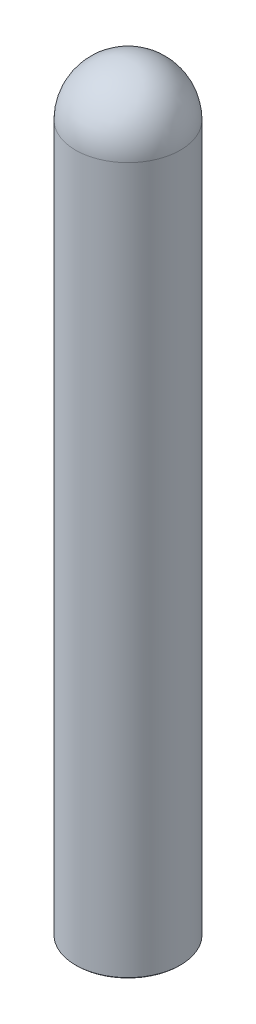
ISO-10303-21;
HEADER;
FILE_DESCRIPTION(('STEP AP214'),'2;1');
FILE_NAME('part.step','',(''),(''),'','','');
FILE_SCHEMA(('AUTOMOTIVE_DESIGN { 1 0 10303 214 1 1 1 1 }'));
ENDSEC;
DATA;
#1=APPLICATION_CONTEXT('core data for automotive mechanical design processes');
#2=APPLICATION_PROTOCOL_DEFINITION('international standard','automotive_design',2000,#1);
#3=PRODUCT_CONTEXT('',#1,'mechanical');
#4=PRODUCT('Part','Part','',(#3));
#5=PRODUCT_RELATED_PRODUCT_CATEGORY('part','',(#4));
#6=PRODUCT_DEFINITION_FORMATION('','',#4);
#7=PRODUCT_DEFINITION_CONTEXT('part definition',#1,'design');
#8=PRODUCT_DEFINITION('design','',#6,#7);
#9=PRODUCT_DEFINITION_SHAPE('','',#8);
#10=(LENGTH_UNIT() NAMED_UNIT(*) SI_UNIT(.MILLI.,.METRE.));
#11=(NAMED_UNIT(*) PLANE_ANGLE_UNIT() SI_UNIT($,.RADIAN.));
#12=(NAMED_UNIT(*) SI_UNIT($,.STERADIAN.) SOLID_ANGLE_UNIT());
#13=UNCERTAINTY_MEASURE_WITH_UNIT(LENGTH_MEASURE(1.E-05),#10,'distance_accuracy_value','');
#14=(GEOMETRIC_REPRESENTATION_CONTEXT(3) GLOBAL_UNCERTAINTY_ASSIGNED_CONTEXT((#13)) GLOBAL_UNIT_ASSIGNED_CONTEXT((#10,
#11,#12)) REPRESENTATION_CONTEXT('',''));
#15=CARTESIAN_POINT('',(0.,0.,0.));
#16=DIRECTION('',(0.,0.,1.));
#17=DIRECTION('',(1.,0.,0.));
#18=AXIS2_PLACEMENT_3D('',#15,#16,#17);
#19=CARTESIAN_POINT('',(0.,0.,0.));
#20=DIRECTION('',(0.,-1.,0.));
#21=DIRECTION('',(0.,0.,-1.));
#22=AXIS2_PLACEMENT_3D('',#19,#20,#21);
#23=PLANE('',#22);
#24=CARTESIAN_POINT('',(0.,0.,0.));
#25=DIRECTION('',(0.,-1.,0.));
#26=DIRECTION('',(0.,0.,-1.));
#27=AXIS2_PLACEMENT_3D('',#24,#25,#26);
#28=CIRCLE('',#27,1.96);
#29=CARTESIAN_POINT('',(0.,0.,1.96));
#30=VERTEX_POINT('',#29);
#31=EDGE_CURVE('E10',#30,#30,#28,.T.);
#32=ORIENTED_EDGE('',*,*,#31,.T.);
#33=EDGE_LOOP('',(#32));
#34=FACE_BOUND('',#33,.T.);
#35=CARTESIAN_POINT('',(0.,0.,0.));
#36=DIRECTION('',(0.,1.,0.));
#37=DIRECTION('',(0.,0.,1.));
#38=AXIS2_PLACEMENT_3D('',#35,#36,#37);
#39=CIRCLE('',#38,1.);
#40=CARTESIAN_POINT('',(0.,0.,1.));
#41=VERTEX_POINT('',#40);
#42=EDGE_CURVE('E44',#41,#41,#39,.T.);
#43=ORIENTED_EDGE('',*,*,#42,.T.);
#44=EDGE_LOOP('',(#43));
#45=FACE_BOUND('',#44,.T.);
#46=ADVANCED_FACE('F33',(#34,#45),#23,.T.);
#47=CARTESIAN_POINT('',(0.,0.,0.));
#48=DIRECTION('',(0.,1.,0.));
#49=DIRECTION('',(0.,0.,1.));
#50=AXIS2_PLACEMENT_3D('',#47,#48,#49);
#51=CYLINDRICAL_SURFACE('',#50,1.);
#52=CARTESIAN_POINT('',(0.,27.,0.));
#53=DIRECTION('',(0.,-1.,0.));
#54=DIRECTION('',(1.,0.,0.));
#55=AXIS2_PLACEMENT_3D('',#52,#53,#54);
#56=CIRCLE('',#55,1.);
#57=CARTESIAN_POINT('',(1.,27.,0.));
#58=VERTEX_POINT('',#57);
#59=EDGE_CURVE('E52',#58,#58,#56,.T.);
#60=ORIENTED_EDGE('',*,*,#59,.F.);
#61=EDGE_LOOP('',(#60));
#62=FACE_BOUND('',#61,.T.);
#63=ORIENTED_EDGE('',*,*,#42,.F.);
#64=EDGE_LOOP('',(#63));
#65=FACE_BOUND('',#64,.T.);
#66=ADVANCED_FACE('F59',(#62,#65),#51,.F.);
#67=CARTESIAN_POINT('',(0.,27.,0.));
#68=DIRECTION('',(0.,1.,0.));
#69=DIRECTION('',(1.,0.,0.));
#70=AXIS2_PLACEMENT_3D('',#67,#68,#69);
#71=SPHERICAL_SURFACE('',#70,2.);
#72=CARTESIAN_POINT('',(0.,27.,0.));
#73=DIRECTION('',(0.,1.,0.));
#74=DIRECTION('',(0.,0.,1.));
#75=AXIS2_PLACEMENT_3D('',#72,#73,#74);
#76=CIRCLE('',#75,2.);
#77=CARTESIAN_POINT('',(0.,27.,2.));
#78=VERTEX_POINT('',#77);
#79=EDGE_CURVE('E48',#78,#78,#76,.T.);
#80=ORIENTED_EDGE('',*,*,#79,.T.);
#81=EDGE_LOOP('',(#80));
#82=FACE_BOUND('',#81,.T.);
#83=ADVANCED_FACE('F62',(#82),#71,.T.);
#84=CARTESIAN_POINT('',(0.,0.,0.));
#85=DIRECTION('',(0.,1.,0.));
#86=DIRECTION('',(0.,0.,1.));
#87=AXIS2_PLACEMENT_3D('',#84,#85,#86);
#88=CYLINDRICAL_SURFACE('',#87,2.);
#89=CARTESIAN_POINT('',(0.,0.0400000000000005,0.));
#90=DIRECTION('',(0.,-1.,0.));
#91=DIRECTION('',(0.,0.,-1.));
#92=AXIS2_PLACEMENT_3D('',#89,#90,#91);
#93=CIRCLE('',#92,2.);
#94=CARTESIAN_POINT('',(0.,0.0400000000000005,2.));
#95=VERTEX_POINT('',#94);
#96=EDGE_CURVE('E40',#95,#95,#93,.F.);
#97=ORIENTED_EDGE('',*,*,#96,.T.);
#98=EDGE_LOOP('',(#97));
#99=FACE_BOUND('',#98,.T.);
#100=ORIENTED_EDGE('',*,*,#79,.F.);
#101=EDGE_LOOP('',(#100));
#102=FACE_BOUND('',#101,.T.);
#103=ADVANCED_FACE('F72',(#99,#102),#88,.T.);
#104=CARTESIAN_POINT('',(-2.,27.,0.));
#105=DIRECTION('',(0.,-1.,0.));
#106=DIRECTION('',(1.,0.,0.));
#107=AXIS2_PLACEMENT_3D('',#104,#105,#106);
#108=PLANE('',#107);
#109=ORIENTED_EDGE('',*,*,#59,.T.);
#110=EDGE_LOOP('',(#109));
#111=FACE_BOUND('',#110,.T.);
#112=ADVANCED_FACE('F57',(#111),#108,.T.);
#113=CARTESIAN_POINT('',(0.,0.0400000000000005,0.));
#114=DIRECTION('',(0.,1.,0.));
#115=DIRECTION('',(0.,0.,1.));
#116=AXIS2_PLACEMENT_3D('',#113,#114,#115);
#117=CONICAL_SURFACE('',#116,2.,0.785398163397492);
#118=CARTESIAN_POINT('',(0.,0.,1.96));
#119=CARTESIAN_POINT('',(0.,0.000416666666666797,1.96041666666666));
#120=CARTESIAN_POINT('',(0.,0.000833333333333429,1.96083333333333));
#121=CARTESIAN_POINT('',(0.,0.00166666666666669,1.96166666666666));
#122=CARTESIAN_POINT('',(0.,0.00208333333333332,1.96208333333333));
#123=CARTESIAN_POINT('',(0.,0.00291666666666669,1.96291666666666));
#124=CARTESIAN_POINT('',(0.,0.00333333333333342,1.96333333333333));
#125=CARTESIAN_POINT('',(0.,0.00416666666666677,1.96416666666666));
#126=CARTESIAN_POINT('',(0.,0.00458333333333338,1.96458333333333));
#127=CARTESIAN_POINT('',(0.,0.00541666666666669,1.96541666666666));
#128=CARTESIAN_POINT('',(0.,0.00583333333333339,1.96583333333333));
#129=CARTESIAN_POINT('',(0.,0.00666666666666679,1.96666666666666));
#130=CARTESIAN_POINT('',(0.,0.00708333333333349,1.96708333333333));
#131=CARTESIAN_POINT('',(0.,0.0079166666666668,1.96791666666666));
#132=CARTESIAN_POINT('',(0.,0.00833333333333341,1.96833333333333));
#133=CARTESIAN_POINT('',(0.,0.00916666666666676,1.96916666666666));
#134=CARTESIAN_POINT('',(0.,0.0095833333333335,1.96958333333333));
#135=CARTESIAN_POINT('',(0.,0.0104166666666668,1.97041666666666));
#136=CARTESIAN_POINT('',(0.,0.0108333333333335,1.97083333333333));
#137=CARTESIAN_POINT('',(0.,0.0116666666666668,1.97166666666666));
#138=CARTESIAN_POINT('',(0.,0.0120833333333335,1.97208333333333));
#139=CARTESIAN_POINT('',(0.,0.0129166666666669,1.97291666666666));
#140=CARTESIAN_POINT('',(0.,0.0133333333333336,1.97333333333333));
#141=CARTESIAN_POINT('',(0.,0.0141666666666669,1.97416666666666));
#142=CARTESIAN_POINT('',(0.,0.0145833333333335,1.97458333333333));
#143=CARTESIAN_POINT('',(0.,0.0154166666666668,1.97541666666666));
#144=CARTESIAN_POINT('',(0.,0.0158333333333336,1.97583333333333));
#145=CARTESIAN_POINT('',(0.,0.0166666666666669,1.97666666666666));
#146=CARTESIAN_POINT('',(0.,0.0170833333333335,1.97708333333333));
#147=CARTESIAN_POINT('',(0.,0.0179166666666669,1.97791666666667));
#148=CARTESIAN_POINT('',(0.,0.0183333333333336,1.97833333333333));
#149=CARTESIAN_POINT('',(0.,0.019166666666667,1.97916666666667));
#150=CARTESIAN_POINT('',(0.,0.0195833333333337,1.97958333333333));
#151=CARTESIAN_POINT('',(0.,0.020416666666667,1.98041666666666));
#152=CARTESIAN_POINT('',(0.,0.0208333333333336,1.98083333333333));
#153=CARTESIAN_POINT('',(0.,0.0216666666666669,1.98166666666667));
#154=CARTESIAN_POINT('',(0.,0.0220833333333337,1.98208333333333));
#155=CARTESIAN_POINT('',(0.,0.022916666666667,1.98291666666667));
#156=CARTESIAN_POINT('',(0.,0.0233333333333336,1.98333333333333));
#157=CARTESIAN_POINT('',(0.,0.024166666666667,1.98416666666667));
#158=CARTESIAN_POINT('',(0.,0.0245833333333337,1.98458333333333));
#159=CARTESIAN_POINT('',(0.,0.025416666666667,1.98541666666667));
#160=CARTESIAN_POINT('',(0.,0.0258333333333337,1.98583333333333));
#161=CARTESIAN_POINT('',(0.,0.026666666666667,1.98666666666667));
#162=CARTESIAN_POINT('',(0.,0.0270833333333337,1.98708333333333));
#163=CARTESIAN_POINT('',(0.,0.0279166666666671,1.98791666666667));
#164=CARTESIAN_POINT('',(0.,0.0283333333333338,1.98833333333333));
#165=CARTESIAN_POINT('',(0.,0.0291666666666671,1.98916666666667));
#166=CARTESIAN_POINT('',(0.,0.0295833333333337,1.98958333333333));
#167=CARTESIAN_POINT('',(0.,0.030416666666667,1.99041666666667));
#168=CARTESIAN_POINT('',(0.,0.0308333333333338,1.99083333333333));
#169=CARTESIAN_POINT('',(0.,0.0316666666666671,1.99166666666667));
#170=CARTESIAN_POINT('',(0.,0.0320833333333337,1.99208333333333));
#171=CARTESIAN_POINT('',(0.,0.0329166666666671,1.99291666666667));
#172=CARTESIAN_POINT('',(0.,0.0333333333333338,1.99333333333333));
#173=CARTESIAN_POINT('',(0.,0.0341666666666672,1.99416666666667));
#174=CARTESIAN_POINT('',(0.,0.0345833333333339,1.99458333333333));
#175=CARTESIAN_POINT('',(0.,0.0354166666666672,1.99541666666667));
#176=CARTESIAN_POINT('',(0.,0.0358333333333338,1.99583333333333));
#177=CARTESIAN_POINT('',(0.,0.0366666666666671,1.99666666666667));
#178=CARTESIAN_POINT('',(0.,0.0370833333333339,1.99708333333333));
#179=CARTESIAN_POINT('',(0.,0.0379166666666672,1.99791666666667));
#180=CARTESIAN_POINT('',(0.,0.0383333333333339,1.99833333333333));
#181=CARTESIAN_POINT('',(0.,0.0391666666666671,1.99916666666667));
#182=CARTESIAN_POINT('',(0.,0.0395833333333337,1.99958333333333));
#183=CARTESIAN_POINT('',(0.,0.0400000000000005,2.));
#184=B_SPLINE_CURVE_WITH_KNOTS('',3,(#118,#119,#120,#121,#122,#123,#124,#125,#126,#127,#128,
#129,#130,#131,#132,#133,#134,#135,#136,#137,#138,#139,#140,#141,#142,#143,#144,#145,#146,#147,
#148,#149,#150,#151,#152,#153,#154,#155,#156,#157,#158,#159,#160,#161,#162,#163,#164,#165,#166,
#167,#168,#169,#170,#171,#172,#173,#174,#175,#176,#177,#178,#179,#180,#181,#182,#183),
.UNSPECIFIED.,.F.,.F.,(4,2,2,2,2,2,2,2,2,2,2,2,2,2,2,2,2,2,2,2,2,2,2,2,2,2,2,2,2,2,2,2,4),(0.,
0.00176776695296634,0.003535533905933,0.00530330085889934,0.00707106781186599,
0.00883883476483234,0.0106066017177987,0.0123743686707653,0.0141421356237317,0.0159099025766983,
0.0176776695296647,0.019445436482631,0.0212132034355977,0.022980970388564,0.0247487373415307,
0.026516504294497,0.0282842712474634,0.03005203820043,0.0318198051533964,0.033587572106363,
0.0353553390593293,0.037123106012296,0.0388908729652623,0.0406586399182287,0.0424264068711953,
0.0441941738241617,0.0459619407771283,0.0477297077300947,0.049497474683061,0.0512652416360277,
0.053033008588994,0.0548007755419607,0.056568542494927),.UNSPECIFIED.);
#185=EDGE_CURVE('BSEAM35',#30,#95,#184,.T.);
#186=ORIENTED_EDGE('',*,*,#31,.F.);
#187=ORIENTED_EDGE('',*,*,#96,.F.);
#188=ORIENTED_EDGE('',*,*,#185,.T.);
#189=ORIENTED_EDGE('',*,*,#185,.F.);
#190=EDGE_LOOP('',(#186,#188,#187,#189));
#191=FACE_BOUND('',#190,.T.);
#192=ADVANCED_FACE('F35',(#191),#117,.T.);
#193=CLOSED_SHELL('',(#46,#66,#83,#103,#112,#192));
#194=MANIFOLD_SOLID_BREP('B2',#193);
#195=ADVANCED_BREP_SHAPE_REPRESENTATION('',(#18,#194),#14);
#196=SHAPE_DEFINITION_REPRESENTATION(#9,#195);
ENDSEC;
END-ISO-10303-21;
